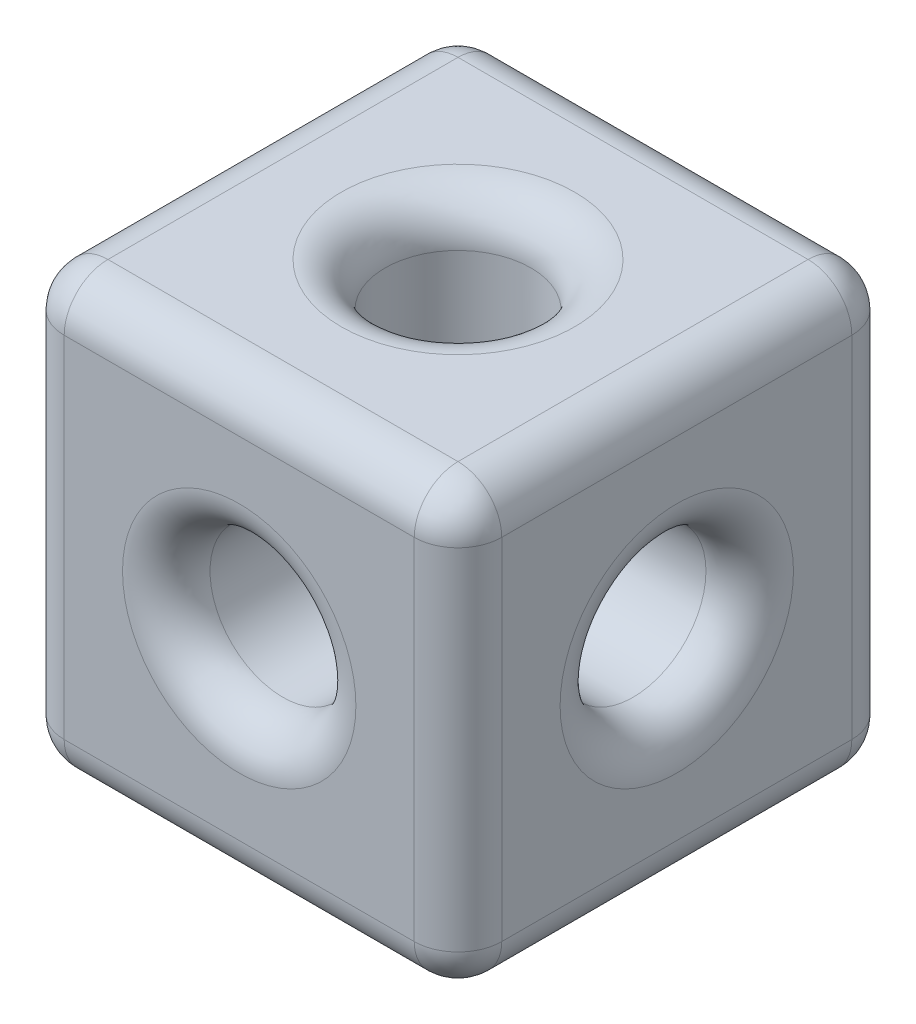
ISO-10303-21;
HEADER;
FILE_DESCRIPTION(('STEP AP214'),'2;1');
FILE_NAME('part.step','',(''),(''),'','','');
FILE_SCHEMA(('AUTOMOTIVE_DESIGN { 1 0 10303 214 1 1 1 1 }'));
ENDSEC;
DATA;
#1=APPLICATION_CONTEXT('core data for automotive mechanical design processes');
#2=APPLICATION_PROTOCOL_DEFINITION('international standard','automotive_design',2000,#1);
#3=PRODUCT_CONTEXT('',#1,'mechanical');
#4=PRODUCT('Part','Part','',(#3));
#5=PRODUCT_RELATED_PRODUCT_CATEGORY('part','',(#4));
#6=PRODUCT_DEFINITION_FORMATION('','',#4);
#7=PRODUCT_DEFINITION_CONTEXT('part definition',#1,'design');
#8=PRODUCT_DEFINITION('design','',#6,#7);
#9=PRODUCT_DEFINITION_SHAPE('','',#8);
#10=(LENGTH_UNIT() NAMED_UNIT(*) SI_UNIT(.MILLI.,.METRE.));
#11=(NAMED_UNIT(*) PLANE_ANGLE_UNIT() SI_UNIT($,.RADIAN.));
#12=(NAMED_UNIT(*) SI_UNIT($,.STERADIAN.) SOLID_ANGLE_UNIT());
#13=UNCERTAINTY_MEASURE_WITH_UNIT(LENGTH_MEASURE(1.E-05),#10,'distance_accuracy_value','');
#14=(GEOMETRIC_REPRESENTATION_CONTEXT(3) GLOBAL_UNCERTAINTY_ASSIGNED_CONTEXT((#13)) GLOBAL_UNIT_ASSIGNED_CONTEXT((#10,
#11,#12)) REPRESENTATION_CONTEXT('',''));
#15=CARTESIAN_POINT('',(0.,0.,0.));
#16=DIRECTION('',(0.,0.,1.));
#17=DIRECTION('',(1.,0.,0.));
#18=AXIS2_PLACEMENT_3D('',#15,#16,#17);
#19=CARTESIAN_POINT('',(0.,0.,-3.));
#20=DIRECTION('',(0.,0.,1.));
#21=DIRECTION('',(1.,0.,0.));
#22=AXIS2_PLACEMENT_3D('',#19,#20,#21);
#23=CYLINDRICAL_SURFACE('',#22,1.);
#24=CARTESIAN_POINT('',(0.,0.,2.4));
#25=DIRECTION('',(0.,0.,1.));
#26=DIRECTION('',(1.,0.,0.));
#27=AXIS2_PLACEMENT_3D('',#24,#25,#26);
#28=CIRCLE('',#27,1.);
#29=CARTESIAN_POINT('',(1.,0.,2.4));
#30=VERTEX_POINT('',#29);
#31=EDGE_CURVE('E255',#30,#30,#28,.T.);
#32=ORIENTED_EDGE('',*,*,#31,.T.);
#33=EDGE_LOOP('',(#32));
#34=FACE_BOUND('',#33,.T.);
#35=CARTESIAN_POINT('',(0.,0.,0.));
#36=DIRECTION('',(-0.707106781186547,0.,0.707106781186547));
#37=DIRECTION('',(0.707106781186547,0.,0.707106781186547));
#38=AXIS2_PLACEMENT_3D('',#35,#36,#37);
#39=ELLIPSE('',#38,1.41421356237309,1.);
#40=CARTESIAN_POINT('',(0.707106781186547,0.707106781186547,0.707106781186547));
#41=VERTEX_POINT('',#40);
#42=CARTESIAN_POINT('',(0.707106781186547,-0.707106781186547,0.707106781186547));
#43=VERTEX_POINT('',#42);
#44=EDGE_CURVE('E170',#41,#43,#39,.F.);
#45=ORIENTED_EDGE('',*,*,#44,.T.);
#46=CARTESIAN_POINT('',(0.,0.,0.));
#47=DIRECTION('',(0.,0.707106781186547,0.707106781186547));
#48=DIRECTION('',(0.,-0.707106781186547,0.707106781186547));
#49=AXIS2_PLACEMENT_3D('',#46,#47,#48);
#50=ELLIPSE('',#49,1.41421356237309,1.);
#51=CARTESIAN_POINT('',(-0.707106781186547,-0.707106781186547,0.707106781186547));
#52=VERTEX_POINT('',#51);
#53=EDGE_CURVE('E154',#43,#52,#50,.F.);
#54=ORIENTED_EDGE('',*,*,#53,.T.);
#55=CARTESIAN_POINT('',(0.,0.,0.));
#56=DIRECTION('',(0.707106781186547,0.,0.707106781186547));
#57=DIRECTION('',(-0.707106781186547,0.,0.707106781186547));
#58=AXIS2_PLACEMENT_3D('',#55,#56,#57);
#59=ELLIPSE('',#58,1.41421356237309,1.);
#60=CARTESIAN_POINT('',(-0.707106781186547,0.707106781186547,0.707106781186547));
#61=VERTEX_POINT('',#60);
#62=EDGE_CURVE('E163',#52,#61,#59,.F.);
#63=ORIENTED_EDGE('',*,*,#62,.T.);
#64=CARTESIAN_POINT('',(0.,0.,0.));
#65=DIRECTION('',(0.,-0.707106781186547,0.707106781186547));
#66=DIRECTION('',(0.,0.707106781186547,0.707106781186547));
#67=AXIS2_PLACEMENT_3D('',#64,#65,#66);
#68=ELLIPSE('',#67,1.41421356237309,1.);
#69=EDGE_CURVE('E343',#61,#41,#68,.F.);
#70=ORIENTED_EDGE('',*,*,#69,.T.);
#71=EDGE_LOOP('',(#45,#54,#63,#70));
#72=FACE_BOUND('',#71,.T.);
#73=ADVANCED_FACE('F38',(#34,#72),#23,.F.);
#74=CARTESIAN_POINT('',(3.,-3.,3.));
#75=DIRECTION('',(1.,0.,0.));
#76=DIRECTION('',(0.,0.,-1.));
#77=AXIS2_PLACEMENT_3D('',#74,#75,#76);
#78=PLANE('',#77);
#79=CARTESIAN_POINT('',(3.,0.,0.));
#80=DIRECTION('',(1.,0.,0.));
#81=DIRECTION('',(0.,0.,-1.));
#82=AXIS2_PLACEMENT_3D('',#79,#80,#81);
#83=CIRCLE('',#82,1.6);
#84=CARTESIAN_POINT('',(3.,0.,-1.6));
#85=VERTEX_POINT('',#84);
#86=EDGE_CURVE('E207',#85,#85,#83,.F.);
#87=ORIENTED_EDGE('',*,*,#86,.T.);
#88=EDGE_LOOP('',(#87));
#89=FACE_BOUND('',#88,.T.);
#90=DIRECTION('',(0.,1.,0.));
#91=VECTOR('',#90,1.);
#92=CARTESIAN_POINT('',(3.,-3.,2.4));
#93=LINE('',#92,#91);
#94=CARTESIAN_POINT('',(3.,2.4,2.4));
#95=VERTEX_POINT('',#94);
#96=CARTESIAN_POINT('',(3.,-2.4,2.4));
#97=VERTEX_POINT('',#96);
#98=EDGE_CURVE('E200',#95,#97,#93,.F.);
#99=ORIENTED_EDGE('',*,*,#98,.T.);
#100=DIRECTION('',(0.,0.,-1.));
#101=VECTOR('',#100,1.);
#102=CARTESIAN_POINT('',(3.,-2.4,3.));
#103=LINE('',#102,#101);
#104=CARTESIAN_POINT('',(3.,-2.4,-2.4));
#105=VERTEX_POINT('',#104);
#106=EDGE_CURVE('E204',#97,#105,#103,.T.);
#107=ORIENTED_EDGE('',*,*,#106,.T.);
#108=DIRECTION('',(0.,1.,0.));
#109=VECTOR('',#108,1.);
#110=CARTESIAN_POINT('',(3.,-3.,-2.4));
#111=LINE('',#110,#109);
#112=CARTESIAN_POINT('',(3.,2.4,-2.4));
#113=VERTEX_POINT('',#112);
#114=EDGE_CURVE('E202',#105,#113,#111,.T.);
#115=ORIENTED_EDGE('',*,*,#114,.T.);
#116=DIRECTION('',(0.,0.,-1.));
#117=VECTOR('',#116,1.);
#118=CARTESIAN_POINT('',(3.,2.4,3.));
#119=LINE('',#118,#117);
#120=EDGE_CURVE('E198',#113,#95,#119,.F.);
#121=ORIENTED_EDGE('',*,*,#120,.T.);
#122=EDGE_LOOP('',(#99,#107,#115,#121));
#123=FACE_BOUND('',#122,.T.);
#124=ADVANCED_FACE('F366',(#89,#123),#78,.T.);
#125=CARTESIAN_POINT('',(-3.,-3.,3.));
#126=DIRECTION('',(0.,0.,1.));
#127=DIRECTION('',(1.,0.,0.));
#128=AXIS2_PLACEMENT_3D('',#125,#126,#127);
#129=PLANE('',#128);
#130=CARTESIAN_POINT('',(0.,0.,3.));
#131=DIRECTION('',(0.,0.,1.));
#132=DIRECTION('',(1.,0.,0.));
#133=AXIS2_PLACEMENT_3D('',#130,#131,#132);
#134=CIRCLE('',#133,1.6);
#135=CARTESIAN_POINT('',(1.6,0.,3.));
#136=VERTEX_POINT('',#135);
#137=EDGE_CURVE('E252',#136,#136,#134,.F.);
#138=ORIENTED_EDGE('',*,*,#137,.T.);
#139=EDGE_LOOP('',(#138));
#140=FACE_BOUND('',#139,.T.);
#141=DIRECTION('',(0.,1.,0.));
#142=VECTOR('',#141,1.);
#143=CARTESIAN_POINT('',(-2.4,-3.,3.));
#144=LINE('',#143,#142);
#145=CARTESIAN_POINT('',(-2.4,2.4,3.));
#146=VERTEX_POINT('',#145);
#147=CARTESIAN_POINT('',(-2.4,-2.4,3.));
#148=VERTEX_POINT('',#147);
#149=EDGE_CURVE('E247',#146,#148,#144,.F.);
#150=ORIENTED_EDGE('',*,*,#149,.T.);
#151=DIRECTION('',(1.,0.,0.));
#152=VECTOR('',#151,1.);
#153=CARTESIAN_POINT('',(-3.,-2.4,3.));
#154=LINE('',#153,#152);
#155=CARTESIAN_POINT('',(2.4,-2.4,3.));
#156=VERTEX_POINT('',#155);
#157=EDGE_CURVE('E249',#148,#156,#154,.T.);
#158=ORIENTED_EDGE('',*,*,#157,.T.);
#159=DIRECTION('',(0.,1.,0.));
#160=VECTOR('',#159,1.);
#161=CARTESIAN_POINT('',(2.4,-3.,3.));
#162=LINE('',#161,#160);
#163=CARTESIAN_POINT('',(2.4,2.4,3.));
#164=VERTEX_POINT('',#163);
#165=EDGE_CURVE('E245',#156,#164,#162,.T.);
#166=ORIENTED_EDGE('',*,*,#165,.T.);
#167=DIRECTION('',(1.,0.,0.));
#168=VECTOR('',#167,1.);
#169=CARTESIAN_POINT('',(-3.,2.4,3.));
#170=LINE('',#169,#168);
#171=EDGE_CURVE('E243',#164,#146,#170,.F.);
#172=ORIENTED_EDGE('',*,*,#171,.T.);
#173=EDGE_LOOP('',(#150,#158,#166,#172));
#174=FACE_BOUND('',#173,.T.);
#175=ADVANCED_FACE('F371',(#140,#174),#129,.T.);
#176=CARTESIAN_POINT('',(-3.,-3.,3.));
#177=DIRECTION('',(-1.,0.,0.));
#178=DIRECTION('',(0.,0.,1.));
#179=AXIS2_PLACEMENT_3D('',#176,#177,#178);
#180=PLANE('',#179);
#181=CARTESIAN_POINT('',(-3.,0.,0.));
#182=DIRECTION('',(-1.,0.,0.));
#183=DIRECTION('',(0.,0.,1.));
#184=AXIS2_PLACEMENT_3D('',#181,#182,#183);
#185=CIRCLE('',#184,1.6);
#186=CARTESIAN_POINT('',(-3.,0.,1.6));
#187=VERTEX_POINT('',#186);
#188=EDGE_CURVE('E237',#187,#187,#185,.F.);
#189=ORIENTED_EDGE('',*,*,#188,.T.);
#190=EDGE_LOOP('',(#189));
#191=FACE_BOUND('',#190,.T.);
#192=DIRECTION('',(0.,1.,0.));
#193=VECTOR('',#192,1.);
#194=CARTESIAN_POINT('',(-3.,-3.,-2.4));
#195=LINE('',#194,#193);
#196=CARTESIAN_POINT('',(-3.,2.4,-2.4));
#197=VERTEX_POINT('',#196);
#198=CARTESIAN_POINT('',(-3.,-2.4,-2.4));
#199=VERTEX_POINT('',#198);
#200=EDGE_CURVE('E232',#197,#199,#195,.F.);
#201=ORIENTED_EDGE('',*,*,#200,.T.);
#202=DIRECTION('',(0.,0.,1.));
#203=VECTOR('',#202,1.);
#204=CARTESIAN_POINT('',(-3.,-2.4,3.));
#205=LINE('',#204,#203);
#206=CARTESIAN_POINT('',(-3.,-2.4,2.4));
#207=VERTEX_POINT('',#206);
#208=EDGE_CURVE('E234',#199,#207,#205,.T.);
#209=ORIENTED_EDGE('',*,*,#208,.T.);
#210=DIRECTION('',(0.,1.,0.));
#211=VECTOR('',#210,1.);
#212=CARTESIAN_POINT('',(-3.,-3.,2.4));
#213=LINE('',#212,#211);
#214=CARTESIAN_POINT('',(-3.,2.4,2.4));
#215=VERTEX_POINT('',#214);
#216=EDGE_CURVE('E230',#207,#215,#213,.T.);
#217=ORIENTED_EDGE('',*,*,#216,.T.);
#218=DIRECTION('',(0.,0.,1.));
#219=VECTOR('',#218,1.);
#220=CARTESIAN_POINT('',(-3.,2.4,-3.));
#221=LINE('',#220,#219);
#222=EDGE_CURVE('E228',#215,#197,#221,.F.);
#223=ORIENTED_EDGE('',*,*,#222,.T.);
#224=EDGE_LOOP('',(#201,#209,#217,#223));
#225=FACE_BOUND('',#224,.T.);
#226=ADVANCED_FACE('F384',(#191,#225),#180,.T.);
#227=CARTESIAN_POINT('',(-3.,-3.,-3.));
#228=DIRECTION('',(0.,0.,-1.));
#229=DIRECTION('',(-1.,0.,0.));
#230=AXIS2_PLACEMENT_3D('',#227,#228,#229);
#231=PLANE('',#230);
#232=CARTESIAN_POINT('',(0.,0.,-3.));
#233=DIRECTION('',(0.,0.,-1.));
#234=DIRECTION('',(-1.,0.,0.));
#235=AXIS2_PLACEMENT_3D('',#232,#233,#234);
#236=CIRCLE('',#235,1.6);
#237=CARTESIAN_POINT('',(-1.6,0.,-3.));
#238=VERTEX_POINT('',#237);
#239=EDGE_CURVE('E222',#238,#238,#236,.F.);
#240=ORIENTED_EDGE('',*,*,#239,.T.);
#241=EDGE_LOOP('',(#240));
#242=FACE_BOUND('',#241,.T.);
#243=DIRECTION('',(0.,1.,0.));
#244=VECTOR('',#243,1.);
#245=CARTESIAN_POINT('',(2.4,-3.,-3.));
#246=LINE('',#245,#244);
#247=CARTESIAN_POINT('',(2.4,2.4,-3.));
#248=VERTEX_POINT('',#247);
#249=CARTESIAN_POINT('',(2.4,-2.4,-3.));
#250=VERTEX_POINT('',#249);
#251=EDGE_CURVE('E217',#248,#250,#246,.F.);
#252=ORIENTED_EDGE('',*,*,#251,.T.);
#253=DIRECTION('',(-1.,0.,0.));
#254=VECTOR('',#253,1.);
#255=CARTESIAN_POINT('',(-3.,-2.4,-3.));
#256=LINE('',#255,#254);
#257=CARTESIAN_POINT('',(-2.4,-2.4,-3.));
#258=VERTEX_POINT('',#257);
#259=EDGE_CURVE('E219',#250,#258,#256,.T.);
#260=ORIENTED_EDGE('',*,*,#259,.T.);
#261=DIRECTION('',(0.,1.,0.));
#262=VECTOR('',#261,1.);
#263=CARTESIAN_POINT('',(-2.4,-3.,-3.));
#264=LINE('',#263,#262);
#265=CARTESIAN_POINT('',(-2.4,2.4,-3.));
#266=VERTEX_POINT('',#265);
#267=EDGE_CURVE('E215',#258,#266,#264,.T.);
#268=ORIENTED_EDGE('',*,*,#267,.T.);
#269=DIRECTION('',(-1.,0.,0.));
#270=VECTOR('',#269,1.);
#271=CARTESIAN_POINT('',(3.,2.4,-3.));
#272=LINE('',#271,#270);
#273=EDGE_CURVE('E213',#266,#248,#272,.F.);
#274=ORIENTED_EDGE('',*,*,#273,.T.);
#275=EDGE_LOOP('',(#252,#260,#268,#274));
#276=FACE_BOUND('',#275,.T.);
#277=ADVANCED_FACE('F380',(#242,#276),#231,.T.);
#278=CARTESIAN_POINT('',(0.,-3.,0.));
#279=DIRECTION('',(0.,-1.,0.));
#280=DIRECTION('',(0.,0.,-1.));
#281=AXIS2_PLACEMENT_3D('',#278,#279,#280);
#282=PLANE('',#281);
#283=CARTESIAN_POINT('',(0.,-3.,0.));
#284=DIRECTION('',(0.,-1.,0.));
#285=DIRECTION('',(0.,0.,-1.));
#286=AXIS2_PLACEMENT_3D('',#283,#284,#285);
#287=CIRCLE('',#286,1.6);
#288=CARTESIAN_POINT('',(0.,-3.,-1.6));
#289=VERTEX_POINT('',#288);
#290=EDGE_CURVE('E192',#289,#289,#287,.F.);
#291=ORIENTED_EDGE('',*,*,#290,.T.);
#292=EDGE_LOOP('',(#291));
#293=FACE_BOUND('',#292,.T.);
#294=DIRECTION('',(-1.,0.,0.));
#295=VECTOR('',#294,1.);
#296=CARTESIAN_POINT('',(0.,-3.,-2.4));
#297=LINE('',#296,#295);
#298=CARTESIAN_POINT('',(-2.4,-3.,-2.4));
#299=VERTEX_POINT('',#298);
#300=CARTESIAN_POINT('',(2.4,-3.,-2.4));
#301=VERTEX_POINT('',#300);
#302=EDGE_CURVE('E187',#299,#301,#297,.F.);
#303=ORIENTED_EDGE('',*,*,#302,.T.);
#304=DIRECTION('',(0.,0.,-1.));
#305=VECTOR('',#304,1.);
#306=CARTESIAN_POINT('',(2.4,-3.,0.));
#307=LINE('',#306,#305);
#308=CARTESIAN_POINT('',(2.4,-3.,2.4));
#309=VERTEX_POINT('',#308);
#310=EDGE_CURVE('E189',#301,#309,#307,.F.);
#311=ORIENTED_EDGE('',*,*,#310,.T.);
#312=DIRECTION('',(1.,0.,0.));
#313=VECTOR('',#312,1.);
#314=CARTESIAN_POINT('',(0.,-3.,2.4));
#315=LINE('',#314,#313);
#316=CARTESIAN_POINT('',(-2.4,-3.,2.4));
#317=VERTEX_POINT('',#316);
#318=EDGE_CURVE('E183',#309,#317,#315,.F.);
#319=ORIENTED_EDGE('',*,*,#318,.T.);
#320=DIRECTION('',(0.,0.,1.));
#321=VECTOR('',#320,1.);
#322=CARTESIAN_POINT('',(-2.4,-3.,0.));
#323=LINE('',#322,#321);
#324=EDGE_CURVE('E185',#317,#299,#323,.F.);
#325=ORIENTED_EDGE('',*,*,#324,.T.);
#326=EDGE_LOOP('',(#303,#311,#319,#325));
#327=FACE_BOUND('',#326,.T.);
#328=ADVANCED_FACE('F377',(#293,#327),#282,.T.);
#329=CARTESIAN_POINT('',(0.,3.,0.));
#330=DIRECTION('',(0.,-1.,0.));
#331=DIRECTION('',(0.,0.,-1.));
#332=AXIS2_PLACEMENT_3D('',#329,#330,#331);
#333=PLANE('',#332);
#334=DIRECTION('',(0.,0.,1.));
#335=VECTOR('',#334,1.);
#336=CARTESIAN_POINT('',(-2.4,3.,3.));
#337=LINE('',#336,#335);
#338=CARTESIAN_POINT('',(-2.4,3.,-2.4));
#339=VERTEX_POINT('',#338);
#340=CARTESIAN_POINT('',(-2.4,3.,2.4));
#341=VERTEX_POINT('',#340);
#342=EDGE_CURVE('E55',#339,#341,#337,.T.);
#343=ORIENTED_EDGE('',*,*,#342,.T.);
#344=DIRECTION('',(1.,0.,0.));
#345=VECTOR('',#344,1.);
#346=CARTESIAN_POINT('',(3.,3.,2.4));
#347=LINE('',#346,#345);
#348=CARTESIAN_POINT('',(2.4,3.,2.4));
#349=VERTEX_POINT('',#348);
#350=EDGE_CURVE('E47',#341,#349,#347,.T.);
#351=ORIENTED_EDGE('',*,*,#350,.T.);
#352=DIRECTION('',(0.,0.,-1.));
#353=VECTOR('',#352,1.);
#354=CARTESIAN_POINT('',(2.4,3.,-3.));
#355=LINE('',#354,#353);
#356=CARTESIAN_POINT('',(2.4,3.,-2.4));
#357=VERTEX_POINT('',#356);
#358=EDGE_CURVE('E261',#349,#357,#355,.T.);
#359=ORIENTED_EDGE('',*,*,#358,.T.);
#360=DIRECTION('',(-1.,0.,0.));
#361=VECTOR('',#360,1.);
#362=CARTESIAN_POINT('',(-3.,3.,-2.4));
#363=LINE('',#362,#361);
#364=EDGE_CURVE('E60',#357,#339,#363,.T.);
#365=ORIENTED_EDGE('',*,*,#364,.T.);
#366=EDGE_LOOP('',(#343,#351,#359,#365));
#367=FACE_BOUND('',#366,.T.);
#368=CARTESIAN_POINT('',(0.,3.,0.));
#369=DIRECTION('',(0.,-1.,0.));
#370=DIRECTION('',(0.,0.,-1.));
#371=AXIS2_PLACEMENT_3D('',#368,#369,#370);
#372=CIRCLE('',#371,1.6);
#373=CARTESIAN_POINT('',(0.,3.,-1.6));
#374=VERTEX_POINT('',#373);
#375=EDGE_CURVE('E258',#374,#374,#372,.T.);
#376=ORIENTED_EDGE('',*,*,#375,.T.);
#377=EDGE_LOOP('',(#376));
#378=FACE_BOUND('',#377,.T.);
#379=ADVANCED_FACE('F361',(#367,#378),#333,.F.);
#380=CARTESIAN_POINT('',(0.,0.,-2.4));
#381=DIRECTION('',(0.,0.,-1.));
#382=DIRECTION('',(-1.,0.,0.));
#383=AXIS2_PLACEMENT_3D('',#380,#381,#382);
#384=CIRCLE('',#383,1.);
#385=CARTESIAN_POINT('',(-1.,0.,-2.4));
#386=VERTEX_POINT('',#385);
#387=EDGE_CURVE('E225',#386,#386,#384,.T.);
#388=ORIENTED_EDGE('',*,*,#387,.T.);
#389=EDGE_LOOP('',(#388));
#390=FACE_BOUND('',#389,.T.);
#391=CARTESIAN_POINT('',(0.,0.,0.));
#392=DIRECTION('',(0.707106781186547,0.,0.707106781186547));
#393=DIRECTION('',(-0.707106781186547,0.,0.707106781186547));
#394=AXIS2_PLACEMENT_3D('',#391,#392,#393);
#395=ELLIPSE('',#394,1.41421356237309,1.);
#396=CARTESIAN_POINT('',(0.707106781186547,-0.707106781186547,-0.707106781186547));
#397=VERTEX_POINT('',#396);
#398=CARTESIAN_POINT('',(0.707106781186547,0.707106781186547,-0.707106781186547));
#399=VERTEX_POINT('',#398);
#400=EDGE_CURVE('E175',#397,#399,#395,.T.);
#401=ORIENTED_EDGE('',*,*,#400,.T.);
#402=CARTESIAN_POINT('',(0.,0.,0.));
#403=DIRECTION('',(0.,0.707106781186547,0.707106781186547));
#404=DIRECTION('',(0.,-0.707106781186547,0.707106781186547));
#405=AXIS2_PLACEMENT_3D('',#402,#403,#404);
#406=ELLIPSE('',#405,1.41421356237309,1.);
#407=CARTESIAN_POINT('',(-0.707106781186547,0.707106781186547,-0.707106781186547));
#408=VERTEX_POINT('',#407);
#409=EDGE_CURVE('E340',#399,#408,#406,.T.);
#410=ORIENTED_EDGE('',*,*,#409,.T.);
#411=CARTESIAN_POINT('',(0.,0.,0.));
#412=DIRECTION('',(-0.707106781186547,0.,0.707106781186547));
#413=DIRECTION('',(0.707106781186547,0.,0.707106781186547));
#414=AXIS2_PLACEMENT_3D('',#411,#412,#413);
#415=ELLIPSE('',#414,1.41421356237309,1.);
#416=CARTESIAN_POINT('',(-0.707106781186547,-0.707106781186547,-0.707106781186547));
#417=VERTEX_POINT('',#416);
#418=EDGE_CURVE('E178',#408,#417,#415,.T.);
#419=ORIENTED_EDGE('',*,*,#418,.T.);
#420=CARTESIAN_POINT('',(0.,0.,0.));
#421=DIRECTION('',(0.,-0.707106781186547,0.707106781186547));
#422=DIRECTION('',(0.,0.707106781186547,0.707106781186547));
#423=AXIS2_PLACEMENT_3D('',#420,#421,#422);
#424=ELLIPSE('',#423,1.41421356237309,1.);
#425=EDGE_CURVE('E157',#417,#397,#424,.T.);
#426=ORIENTED_EDGE('',*,*,#425,.T.);
#427=EDGE_LOOP('',(#401,#410,#419,#426));
#428=FACE_BOUND('',#427,.T.);
#429=ADVANCED_FACE('F348',(#390,#428),#23,.F.);
#430=CARTESIAN_POINT('',(-3.,0.,0.));
#431=DIRECTION('',(1.,0.,0.));
#432=DIRECTION('',(0.,0.,-1.));
#433=AXIS2_PLACEMENT_3D('',#430,#431,#432);
#434=CYLINDRICAL_SURFACE('',#433,1.);
#435=CARTESIAN_POINT('',(2.4,0.,0.));
#436=DIRECTION('',(1.,0.,0.));
#437=DIRECTION('',(0.,0.,-1.));
#438=AXIS2_PLACEMENT_3D('',#435,#436,#437);
#439=CIRCLE('',#438,1.);
#440=CARTESIAN_POINT('',(2.4,0.,-1.));
#441=VERTEX_POINT('',#440);
#442=EDGE_CURVE('E210',#441,#441,#439,.T.);
#443=ORIENTED_EDGE('',*,*,#442,.T.);
#444=EDGE_LOOP('',(#443));
#445=FACE_BOUND('',#444,.T.);
#446=ORIENTED_EDGE('',*,*,#400,.F.);
#447=CARTESIAN_POINT('',(0.,0.,0.));
#448=DIRECTION('',(0.707106781186547,0.707106781186547,0.));
#449=DIRECTION('',(0.707106781186547,-0.707106781186547,0.));
#450=AXIS2_PLACEMENT_3D('',#447,#448,#449);
#451=ELLIPSE('',#450,1.41421356237309,1.);
#452=EDGE_CURVE('E171',#397,#43,#451,.F.);
#453=ORIENTED_EDGE('',*,*,#452,.T.);
#454=ORIENTED_EDGE('',*,*,#44,.F.);
#455=CARTESIAN_POINT('',(0.,0.,0.));
#456=DIRECTION('',(0.707106781186547,-0.707106781186547,0.));
#457=DIRECTION('',(0.707106781186547,0.707106781186547,0.));
#458=AXIS2_PLACEMENT_3D('',#455,#456,#457);
#459=ELLIPSE('',#458,1.41421356237309,1.);
#460=EDGE_CURVE('E345',#41,#399,#459,.F.);
#461=ORIENTED_EDGE('',*,*,#460,.T.);
#462=EDGE_LOOP('',(#446,#453,#454,#461));
#463=FACE_BOUND('',#462,.T.);
#464=ADVANCED_FACE('F352',(#445,#463),#434,.F.);
#465=CARTESIAN_POINT('',(-2.4,0.,0.));
#466=DIRECTION('',(-1.,0.,0.));
#467=DIRECTION('',(0.,0.,1.));
#468=AXIS2_PLACEMENT_3D('',#465,#466,#467);
#469=CIRCLE('',#468,1.);
#470=CARTESIAN_POINT('',(-2.4,0.,1.));
#471=VERTEX_POINT('',#470);
#472=EDGE_CURVE('E240',#471,#471,#469,.T.);
#473=ORIENTED_EDGE('',*,*,#472,.T.);
#474=EDGE_LOOP('',(#473));
#475=FACE_BOUND('',#474,.T.);
#476=ORIENTED_EDGE('',*,*,#418,.F.);
#477=CARTESIAN_POINT('',(0.,0.,0.));
#478=DIRECTION('',(0.707106781186547,0.707106781186547,0.));
#479=DIRECTION('',(0.707106781186547,-0.707106781186547,0.));
#480=AXIS2_PLACEMENT_3D('',#477,#478,#479);
#481=ELLIPSE('',#480,1.41421356237309,1.);
#482=EDGE_CURVE('E162',#408,#61,#481,.T.);
#483=ORIENTED_EDGE('',*,*,#482,.T.);
#484=ORIENTED_EDGE('',*,*,#62,.F.);
#485=CARTESIAN_POINT('',(0.,0.,0.));
#486=DIRECTION('',(0.707106781186547,-0.707106781186547,0.));
#487=DIRECTION('',(0.707106781186547,0.707106781186547,0.));
#488=AXIS2_PLACEMENT_3D('',#485,#486,#487);
#489=ELLIPSE('',#488,1.41421356237309,1.);
#490=EDGE_CURVE('E151',#52,#417,#489,.T.);
#491=ORIENTED_EDGE('',*,*,#490,.T.);
#492=EDGE_LOOP('',(#476,#483,#484,#491));
#493=FACE_BOUND('',#492,.T.);
#494=ADVANCED_FACE('F174',(#475,#493),#434,.F.);
#495=CARTESIAN_POINT('',(0.,-3.,0.));
#496=DIRECTION('',(0.,1.,0.));
#497=DIRECTION('',(0.,0.,1.));
#498=AXIS2_PLACEMENT_3D('',#495,#496,#497);
#499=CYLINDRICAL_SURFACE('',#498,1.);
#500=CARTESIAN_POINT('',(0.,-2.4,0.));
#501=DIRECTION('',(0.,-1.,0.));
#502=DIRECTION('',(0.,0.,-1.));
#503=AXIS2_PLACEMENT_3D('',#500,#501,#502);
#504=CIRCLE('',#503,1.);
#505=CARTESIAN_POINT('',(0.,-2.4,-1.));
#506=VERTEX_POINT('',#505);
#507=EDGE_CURVE('E195',#506,#506,#504,.T.);
#508=ORIENTED_EDGE('',*,*,#507,.T.);
#509=EDGE_LOOP('',(#508));
#510=FACE_BOUND('',#509,.T.);
#511=ORIENTED_EDGE('',*,*,#425,.F.);
#512=ORIENTED_EDGE('',*,*,#490,.F.);
#513=ORIENTED_EDGE('',*,*,#53,.F.);
#514=ORIENTED_EDGE('',*,*,#452,.F.);
#515=EDGE_LOOP('',(#511,#512,#513,#514));
#516=FACE_BOUND('',#515,.T.);
#517=ADVANCED_FACE('F153',(#510,#516),#499,.F.);
#518=CARTESIAN_POINT('',(0.,2.4,0.));
#519=DIRECTION('',(0.,-1.,0.));
#520=DIRECTION('',(0.,0.,-1.));
#521=AXIS2_PLACEMENT_3D('',#518,#519,#520);
#522=CIRCLE('',#521,1.);
#523=CARTESIAN_POINT('',(0.,2.4,-1.));
#524=VERTEX_POINT('',#523);
#525=EDGE_CURVE('E11',#524,#524,#522,.F.);
#526=ORIENTED_EDGE('',*,*,#525,.T.);
#527=EDGE_LOOP('',(#526));
#528=FACE_BOUND('',#527,.T.);
#529=ORIENTED_EDGE('',*,*,#69,.F.);
#530=ORIENTED_EDGE('',*,*,#482,.F.);
#531=ORIENTED_EDGE('',*,*,#409,.F.);
#532=ORIENTED_EDGE('',*,*,#460,.F.);
#533=EDGE_LOOP('',(#529,#530,#531,#532));
#534=FACE_BOUND('',#533,.T.);
#535=ADVANCED_FACE('F350',(#528,#534),#499,.F.);
#536=CARTESIAN_POINT('',(0.,-2.4,0.));
#537=DIRECTION('',(0.,-1.,0.));
#538=DIRECTION('',(0.,0.,-1.));
#539=AXIS2_PLACEMENT_3D('',#536,#537,#538);
#540=TOROIDAL_SURFACE('',#539,1.6,0.6);
#541=ORIENTED_EDGE('',*,*,#507,.F.);
#542=EDGE_LOOP('',(#541));
#543=FACE_BOUND('',#542,.T.);
#544=ORIENTED_EDGE('',*,*,#290,.F.);
#545=EDGE_LOOP('',(#544));
#546=FACE_BOUND('',#545,.T.);
#547=ADVANCED_FACE('F392',(#543,#546),#540,.T.);
#548=CARTESIAN_POINT('',(-2.4,2.4,0.));
#549=DIRECTION('',(0.,0.,-1.));
#550=DIRECTION('',(-1.,0.,0.));
#551=AXIS2_PLACEMENT_3D('',#548,#549,#550);
#552=CYLINDRICAL_SURFACE('',#551,0.6);
#553=CARTESIAN_POINT('',(-2.4,2.4,2.4));
#554=DIRECTION('',(0.,0.,1.));
#555=DIRECTION('',(1.,0.,0.));
#556=AXIS2_PLACEMENT_3D('',#553,#554,#555);
#557=CIRCLE('',#556,0.6);
#558=EDGE_CURVE('E42',#341,#215,#557,.T.);
#559=ORIENTED_EDGE('',*,*,#558,.F.);
#560=ORIENTED_EDGE('',*,*,#342,.F.);
#561=CARTESIAN_POINT('',(-2.4,2.4,-2.4));
#562=DIRECTION('',(0.,0.,-1.));
#563=DIRECTION('',(-1.,0.,0.));
#564=AXIS2_PLACEMENT_3D('',#561,#562,#563);
#565=CIRCLE('',#564,0.6);
#566=EDGE_CURVE('E325',#197,#339,#565,.T.);
#567=ORIENTED_EDGE('',*,*,#566,.F.);
#568=ORIENTED_EDGE('',*,*,#222,.F.);
#569=EDGE_LOOP('',(#559,#560,#567,#568));
#570=FACE_BOUND('',#569,.T.);
#571=ADVANCED_FACE('F395',(#570),#552,.T.);
#572=CARTESIAN_POINT('',(-2.4,2.4,2.4));
#573=DIRECTION('',(-1.,0.,0.));
#574=DIRECTION('',(0.,0.,1.));
#575=AXIS2_PLACEMENT_3D('',#572,#573,#574);
#576=SPHERICAL_SURFACE('',#575,0.6);
#577=CARTESIAN_POINT('',(-2.4,2.4,2.4));
#578=DIRECTION('',(-1.,0.,0.));
#579=DIRECTION('',(0.,0.,1.));
#580=AXIS2_PLACEMENT_3D('',#577,#578,#579);
#581=CIRCLE('',#580,0.6);
#582=EDGE_CURVE('E320',#341,#146,#581,.F.);
#583=ORIENTED_EDGE('',*,*,#582,.F.);
#584=ORIENTED_EDGE('',*,*,#558,.T.);
#585=CARTESIAN_POINT('',(-2.4,2.4,2.4));
#586=DIRECTION('',(0.,1.,0.));
#587=DIRECTION('',(0.,0.,1.));
#588=AXIS2_PLACEMENT_3D('',#585,#586,#587);
#589=CIRCLE('',#588,0.6);
#590=EDGE_CURVE('E323',#146,#215,#589,.F.);
#591=ORIENTED_EDGE('',*,*,#590,.F.);
#592=EDGE_LOOP('',(#583,#584,#591));
#593=FACE_BOUND('',#592,.T.);
#594=ADVANCED_FACE('F469',(#593),#576,.T.);
#595=CARTESIAN_POINT('',(-2.4,2.4,-2.4));
#596=DIRECTION('',(0.,1.,0.));
#597=DIRECTION('',(0.,0.,1.));
#598=AXIS2_PLACEMENT_3D('',#595,#596,#597);
#599=SPHERICAL_SURFACE('',#598,0.6);
#600=CARTESIAN_POINT('',(-2.4,2.4,-2.4));
#601=DIRECTION('',(0.,1.,0.));
#602=DIRECTION('',(0.,0.,1.));
#603=AXIS2_PLACEMENT_3D('',#600,#601,#602);
#604=CIRCLE('',#603,0.6);
#605=EDGE_CURVE('E314',#197,#266,#604,.F.);
#606=ORIENTED_EDGE('',*,*,#605,.F.);
#607=ORIENTED_EDGE('',*,*,#566,.T.);
#608=CARTESIAN_POINT('',(-2.4,2.4,-2.4));
#609=DIRECTION('',(-1.,0.,0.));
#610=DIRECTION('',(0.,0.,1.));
#611=AXIS2_PLACEMENT_3D('',#608,#609,#610);
#612=CIRCLE('',#611,0.6);
#613=EDGE_CURVE('E317',#266,#339,#612,.F.);
#614=ORIENTED_EDGE('',*,*,#613,.F.);
#615=EDGE_LOOP('',(#606,#607,#614));
#616=FACE_BOUND('',#615,.T.);
#617=ADVANCED_FACE('F465',(#616),#599,.T.);
#618=CARTESIAN_POINT('',(-2.4,-3.,2.4));
#619=DIRECTION('',(0.,1.,0.));
#620=DIRECTION('',(0.,0.,1.));
#621=AXIS2_PLACEMENT_3D('',#618,#619,#620);
#622=CYLINDRICAL_SURFACE('',#621,0.6);
#623=ORIENTED_EDGE('',*,*,#590,.T.);
#624=ORIENTED_EDGE('',*,*,#216,.F.);
#625=CARTESIAN_POINT('',(-2.4,-2.4,2.4));
#626=DIRECTION('',(0.,-1.,0.));
#627=DIRECTION('',(0.,0.,-1.));
#628=AXIS2_PLACEMENT_3D('',#625,#626,#627);
#629=CIRCLE('',#628,0.6);
#630=EDGE_CURVE('E309',#148,#207,#629,.T.);
#631=ORIENTED_EDGE('',*,*,#630,.F.);
#632=ORIENTED_EDGE('',*,*,#149,.F.);
#633=EDGE_LOOP('',(#623,#624,#631,#632));
#634=FACE_BOUND('',#633,.T.);
#635=ADVANCED_FACE('F461',(#634),#622,.T.);
#636=CARTESIAN_POINT('',(0.,2.4,2.4));
#637=DIRECTION('',(-1.,0.,0.));
#638=DIRECTION('',(0.,0.,1.));
#639=AXIS2_PLACEMENT_3D('',#636,#637,#638);
#640=CYLINDRICAL_SURFACE('',#639,0.6);
#641=ORIENTED_EDGE('',*,*,#582,.T.);
#642=ORIENTED_EDGE('',*,*,#171,.F.);
#643=CARTESIAN_POINT('',(2.4,2.4,2.4));
#644=DIRECTION('',(1.,0.,0.));
#645=DIRECTION('',(0.,0.,-1.));
#646=AXIS2_PLACEMENT_3D('',#643,#644,#645);
#647=CIRCLE('',#646,0.6);
#648=EDGE_CURVE('E306',#349,#164,#647,.T.);
#649=ORIENTED_EDGE('',*,*,#648,.F.);
#650=ORIENTED_EDGE('',*,*,#350,.F.);
#651=EDGE_LOOP('',(#641,#642,#649,#650));
#652=FACE_BOUND('',#651,.T.);
#653=ADVANCED_FACE('F457',(#652),#640,.T.);
#654=CARTESIAN_POINT('',(2.4,2.4,0.));
#655=DIRECTION('',(0.,0.,1.));
#656=DIRECTION('',(1.,0.,0.));
#657=AXIS2_PLACEMENT_3D('',#654,#655,#656);
#658=CYLINDRICAL_SURFACE('',#657,0.6);
#659=CARTESIAN_POINT('',(2.4,2.4,-2.4));
#660=DIRECTION('',(0.,0.,-1.));
#661=DIRECTION('',(-1.,0.,0.));
#662=AXIS2_PLACEMENT_3D('',#659,#660,#661);
#663=CIRCLE('',#662,0.6);
#664=EDGE_CURVE('E301',#357,#113,#663,.T.);
#665=ORIENTED_EDGE('',*,*,#664,.F.);
#666=ORIENTED_EDGE('',*,*,#358,.F.);
#667=CARTESIAN_POINT('',(2.4,2.4,2.4));
#668=DIRECTION('',(0.,0.,1.));
#669=DIRECTION('',(1.,0.,0.));
#670=AXIS2_PLACEMENT_3D('',#667,#668,#669);
#671=CIRCLE('',#670,0.6);
#672=EDGE_CURVE('E304',#95,#349,#671,.T.);
#673=ORIENTED_EDGE('',*,*,#672,.F.);
#674=ORIENTED_EDGE('',*,*,#120,.F.);
#675=EDGE_LOOP('',(#665,#666,#673,#674));
#676=FACE_BOUND('',#675,.T.);
#677=ADVANCED_FACE('F453',(#676),#658,.T.);
#678=CARTESIAN_POINT('',(0.,2.4,-2.4));
#679=DIRECTION('',(1.,0.,0.));
#680=DIRECTION('',(0.,0.,-1.));
#681=AXIS2_PLACEMENT_3D('',#678,#679,#680);
#682=CYLINDRICAL_SURFACE('',#681,0.6);
#683=ORIENTED_EDGE('',*,*,#613,.T.);
#684=ORIENTED_EDGE('',*,*,#364,.F.);
#685=CARTESIAN_POINT('',(2.4,2.4,-2.4));
#686=DIRECTION('',(1.,0.,0.));
#687=DIRECTION('',(0.,0.,-1.));
#688=AXIS2_PLACEMENT_3D('',#685,#686,#687);
#689=CIRCLE('',#688,0.6);
#690=EDGE_CURVE('E298',#248,#357,#689,.T.);
#691=ORIENTED_EDGE('',*,*,#690,.F.);
#692=ORIENTED_EDGE('',*,*,#273,.F.);
#693=EDGE_LOOP('',(#683,#684,#691,#692));
#694=FACE_BOUND('',#693,.T.);
#695=ADVANCED_FACE('F449',(#694),#682,.T.);
#696=CARTESIAN_POINT('',(-2.4,-3.,-2.4));
#697=DIRECTION('',(0.,1.,0.));
#698=DIRECTION('',(0.,0.,1.));
#699=AXIS2_PLACEMENT_3D('',#696,#697,#698);
#700=CYLINDRICAL_SURFACE('',#699,0.6);
#701=ORIENTED_EDGE('',*,*,#605,.T.);
#702=ORIENTED_EDGE('',*,*,#267,.F.);
#703=CARTESIAN_POINT('',(-2.4,-2.4,-2.4));
#704=DIRECTION('',(0.,-1.,0.));
#705=DIRECTION('',(0.,0.,-1.));
#706=AXIS2_PLACEMENT_3D('',#703,#704,#705);
#707=CIRCLE('',#706,0.6);
#708=EDGE_CURVE('E295',#199,#258,#707,.T.);
#709=ORIENTED_EDGE('',*,*,#708,.F.);
#710=ORIENTED_EDGE('',*,*,#200,.F.);
#711=EDGE_LOOP('',(#701,#702,#709,#710));
#712=FACE_BOUND('',#711,.T.);
#713=ADVANCED_FACE('F445',(#712),#700,.T.);
#714=CARTESIAN_POINT('',(-2.4,-2.4,3.));
#715=DIRECTION('',(0.,0.,1.));
#716=DIRECTION('',(1.,0.,0.));
#717=AXIS2_PLACEMENT_3D('',#714,#715,#716);
#718=CYLINDRICAL_SURFACE('',#717,0.6);
#719=CARTESIAN_POINT('',(-2.4,-2.4,2.4));
#720=DIRECTION('',(0.,0.,1.));
#721=DIRECTION('',(1.,0.,0.));
#722=AXIS2_PLACEMENT_3D('',#719,#720,#721);
#723=CIRCLE('',#722,0.6);
#724=EDGE_CURVE('E311',#207,#317,#723,.T.);
#725=ORIENTED_EDGE('',*,*,#724,.F.);
#726=ORIENTED_EDGE('',*,*,#208,.F.);
#727=CARTESIAN_POINT('',(-2.4,-2.4,-2.4));
#728=DIRECTION('',(0.,0.,-1.));
#729=DIRECTION('',(-1.,0.,0.));
#730=AXIS2_PLACEMENT_3D('',#727,#728,#729);
#731=CIRCLE('',#730,0.6);
#732=EDGE_CURVE('E292',#299,#199,#731,.T.);
#733=ORIENTED_EDGE('',*,*,#732,.F.);
#734=ORIENTED_EDGE('',*,*,#324,.F.);
#735=EDGE_LOOP('',(#725,#726,#733,#734));
#736=FACE_BOUND('',#735,.T.);
#737=ADVANCED_FACE('F441',(#736),#718,.T.);
#738=CARTESIAN_POINT('',(-2.4,-2.4,2.4));
#739=DIRECTION('',(-1.,0.,0.));
#740=DIRECTION('',(0.,0.,1.));
#741=AXIS2_PLACEMENT_3D('',#738,#739,#740);
#742=SPHERICAL_SURFACE('',#741,0.6);
#743=ORIENTED_EDGE('',*,*,#630,.T.);
#744=ORIENTED_EDGE('',*,*,#724,.T.);
#745=CARTESIAN_POINT('',(-2.4,-2.4,2.4));
#746=DIRECTION('',(-1.,0.,0.));
#747=DIRECTION('',(0.,0.,1.));
#748=AXIS2_PLACEMENT_3D('',#745,#746,#747);
#749=CIRCLE('',#748,0.6);
#750=EDGE_CURVE('E289',#148,#317,#749,.F.);
#751=ORIENTED_EDGE('',*,*,#750,.F.);
#752=EDGE_LOOP('',(#743,#744,#751));
#753=FACE_BOUND('',#752,.T.);
#754=ADVANCED_FACE('F437',(#753),#742,.T.);
#755=CARTESIAN_POINT('',(2.4,2.4,2.4));
#756=DIRECTION('',(0.,1.,0.));
#757=DIRECTION('',(0.,0.,1.));
#758=AXIS2_PLACEMENT_3D('',#755,#756,#757);
#759=SPHERICAL_SURFACE('',#758,0.6);
#760=ORIENTED_EDGE('',*,*,#672,.T.);
#761=ORIENTED_EDGE('',*,*,#648,.T.);
#762=CARTESIAN_POINT('',(2.4,2.4,2.4));
#763=DIRECTION('',(0.,1.,0.));
#764=DIRECTION('',(0.,0.,1.));
#765=AXIS2_PLACEMENT_3D('',#762,#763,#764);
#766=CIRCLE('',#765,0.6);
#767=EDGE_CURVE('E286',#95,#164,#766,.F.);
#768=ORIENTED_EDGE('',*,*,#767,.F.);
#769=EDGE_LOOP('',(#760,#761,#768));
#770=FACE_BOUND('',#769,.T.);
#771=ADVANCED_FACE('F433',(#770),#759,.T.);
#772=CARTESIAN_POINT('',(2.4,2.4,-2.4));
#773=DIRECTION('',(0.,1.,0.));
#774=DIRECTION('',(0.,0.,1.));
#775=AXIS2_PLACEMENT_3D('',#772,#773,#774);
#776=SPHERICAL_SURFACE('',#775,0.6);
#777=ORIENTED_EDGE('',*,*,#690,.T.);
#778=ORIENTED_EDGE('',*,*,#664,.T.);
#779=CARTESIAN_POINT('',(2.4,2.4,-2.4));
#780=DIRECTION('',(0.,1.,0.));
#781=DIRECTION('',(0.,0.,1.));
#782=AXIS2_PLACEMENT_3D('',#779,#780,#781);
#783=CIRCLE('',#782,0.6);
#784=EDGE_CURVE('E283',#248,#113,#783,.F.);
#785=ORIENTED_EDGE('',*,*,#784,.F.);
#786=EDGE_LOOP('',(#777,#778,#785));
#787=FACE_BOUND('',#786,.T.);
#788=ADVANCED_FACE('F429',(#787),#776,.T.);
#789=CARTESIAN_POINT('',(-2.4,-2.4,-2.4));
#790=DIRECTION('',(-1.,0.,0.));
#791=DIRECTION('',(0.,0.,1.));
#792=AXIS2_PLACEMENT_3D('',#789,#790,#791);
#793=SPHERICAL_SURFACE('',#792,0.6);
#794=ORIENTED_EDGE('',*,*,#732,.T.);
#795=ORIENTED_EDGE('',*,*,#708,.T.);
#796=CARTESIAN_POINT('',(-2.4,-2.4,-2.4));
#797=DIRECTION('',(-1.,0.,0.));
#798=DIRECTION('',(0.,-1.,0.));
#799=AXIS2_PLACEMENT_3D('',#796,#797,#798);
#800=CIRCLE('',#799,0.6);
#801=EDGE_CURVE('E281',#299,#258,#800,.F.);
#802=ORIENTED_EDGE('',*,*,#801,.F.);
#803=EDGE_LOOP('',(#794,#795,#802));
#804=FACE_BOUND('',#803,.T.);
#805=ADVANCED_FACE('F425',(#804),#793,.T.);
#806=CARTESIAN_POINT('',(-3.,-2.4,2.4));
#807=DIRECTION('',(1.,0.,0.));
#808=DIRECTION('',(0.,0.,-1.));
#809=AXIS2_PLACEMENT_3D('',#806,#807,#808);
#810=CYLINDRICAL_SURFACE('',#809,0.6);
#811=ORIENTED_EDGE('',*,*,#750,.T.);
#812=ORIENTED_EDGE('',*,*,#318,.F.);
#813=CARTESIAN_POINT('',(2.4,-2.4,2.4));
#814=DIRECTION('',(1.,0.,0.));
#815=DIRECTION('',(0.,0.,-1.));
#816=AXIS2_PLACEMENT_3D('',#813,#814,#815);
#817=CIRCLE('',#816,0.6);
#818=EDGE_CURVE('E278',#156,#309,#817,.T.);
#819=ORIENTED_EDGE('',*,*,#818,.F.);
#820=ORIENTED_EDGE('',*,*,#157,.F.);
#821=EDGE_LOOP('',(#811,#812,#819,#820));
#822=FACE_BOUND('',#821,.T.);
#823=ADVANCED_FACE('F421',(#822),#810,.T.);
#824=CARTESIAN_POINT('',(2.4,-3.,2.4));
#825=DIRECTION('',(0.,1.,0.));
#826=DIRECTION('',(0.,0.,1.));
#827=AXIS2_PLACEMENT_3D('',#824,#825,#826);
#828=CYLINDRICAL_SURFACE('',#827,0.6);
#829=ORIENTED_EDGE('',*,*,#767,.T.);
#830=ORIENTED_EDGE('',*,*,#165,.F.);
#831=CARTESIAN_POINT('',(2.4,-2.4,2.4));
#832=DIRECTION('',(0.,-1.,0.));
#833=DIRECTION('',(0.,0.,-1.));
#834=AXIS2_PLACEMENT_3D('',#831,#832,#833);
#835=CIRCLE('',#834,0.6);
#836=EDGE_CURVE('E276',#97,#156,#835,.T.);
#837=ORIENTED_EDGE('',*,*,#836,.F.);
#838=ORIENTED_EDGE('',*,*,#98,.F.);
#839=EDGE_LOOP('',(#829,#830,#837,#838));
#840=FACE_BOUND('',#839,.T.);
#841=ADVANCED_FACE('F417',(#840),#828,.T.);
#842=CARTESIAN_POINT('',(2.4,-3.,-2.4));
#843=DIRECTION('',(0.,1.,0.));
#844=DIRECTION('',(0.,0.,1.));
#845=AXIS2_PLACEMENT_3D('',#842,#843,#844);
#846=CYLINDRICAL_SURFACE('',#845,0.6);
#847=ORIENTED_EDGE('',*,*,#784,.T.);
#848=ORIENTED_EDGE('',*,*,#114,.F.);
#849=CARTESIAN_POINT('',(2.4,-2.4,-2.4));
#850=DIRECTION('',(0.,-1.,0.));
#851=DIRECTION('',(0.,0.,-1.));
#852=AXIS2_PLACEMENT_3D('',#849,#850,#851);
#853=CIRCLE('',#852,0.6);
#854=EDGE_CURVE('E273',#250,#105,#853,.T.);
#855=ORIENTED_EDGE('',*,*,#854,.F.);
#856=ORIENTED_EDGE('',*,*,#251,.F.);
#857=EDGE_LOOP('',(#847,#848,#855,#856));
#858=FACE_BOUND('',#857,.T.);
#859=ADVANCED_FACE('F413',(#858),#846,.T.);
#860=CARTESIAN_POINT('',(-3.,-2.4,-2.4));
#861=DIRECTION('',(-1.,0.,0.));
#862=DIRECTION('',(0.,0.,1.));
#863=AXIS2_PLACEMENT_3D('',#860,#861,#862);
#864=CYLINDRICAL_SURFACE('',#863,0.6);
#865=ORIENTED_EDGE('',*,*,#801,.T.);
#866=ORIENTED_EDGE('',*,*,#259,.F.);
#867=CARTESIAN_POINT('',(2.4,-2.4,-2.4));
#868=DIRECTION('',(1.,0.,0.));
#869=DIRECTION('',(0.,0.,-1.));
#870=AXIS2_PLACEMENT_3D('',#867,#868,#869);
#871=CIRCLE('',#870,0.6);
#872=EDGE_CURVE('E270',#301,#250,#871,.T.);
#873=ORIENTED_EDGE('',*,*,#872,.F.);
#874=ORIENTED_EDGE('',*,*,#302,.F.);
#875=EDGE_LOOP('',(#865,#866,#873,#874));
#876=FACE_BOUND('',#875,.T.);
#877=ADVANCED_FACE('F409',(#876),#864,.T.);
#878=CARTESIAN_POINT('',(2.4,-2.4,2.4));
#879=DIRECTION('',(0.,0.,1.));
#880=DIRECTION('',(1.,0.,0.));
#881=AXIS2_PLACEMENT_3D('',#878,#879,#880);
#882=SPHERICAL_SURFACE('',#881,0.6);
#883=ORIENTED_EDGE('',*,*,#836,.T.);
#884=ORIENTED_EDGE('',*,*,#818,.T.);
#885=CARTESIAN_POINT('',(2.4,-2.4,2.4));
#886=DIRECTION('',(0.,0.,1.));
#887=DIRECTION('',(1.,0.,0.));
#888=AXIS2_PLACEMENT_3D('',#885,#886,#887);
#889=CIRCLE('',#888,0.6);
#890=EDGE_CURVE('E268',#97,#309,#889,.F.);
#891=ORIENTED_EDGE('',*,*,#890,.F.);
#892=EDGE_LOOP('',(#883,#884,#891));
#893=FACE_BOUND('',#892,.T.);
#894=ADVANCED_FACE('F405',(#893),#882,.T.);
#895=CARTESIAN_POINT('',(2.4,-2.4,-2.4));
#896=DIRECTION('',(0.,0.,-1.));
#897=DIRECTION('',(-1.,0.,0.));
#898=AXIS2_PLACEMENT_3D('',#895,#896,#897);
#899=SPHERICAL_SURFACE('',#898,0.6);
#900=ORIENTED_EDGE('',*,*,#872,.T.);
#901=ORIENTED_EDGE('',*,*,#854,.T.);
#902=CARTESIAN_POINT('',(2.4,-2.4,-2.4));
#903=DIRECTION('',(0.,0.,-1.));
#904=DIRECTION('',(-1.,0.,0.));
#905=AXIS2_PLACEMENT_3D('',#902,#903,#904);
#906=CIRCLE('',#905,0.6);
#907=EDGE_CURVE('E266',#301,#105,#906,.F.);
#908=ORIENTED_EDGE('',*,*,#907,.F.);
#909=EDGE_LOOP('',(#900,#901,#908));
#910=FACE_BOUND('',#909,.T.);
#911=ADVANCED_FACE('F401',(#910),#899,.T.);
#912=CARTESIAN_POINT('',(2.4,-2.4,3.));
#913=DIRECTION('',(0.,0.,-1.));
#914=DIRECTION('',(-1.,0.,0.));
#915=AXIS2_PLACEMENT_3D('',#912,#913,#914);
#916=CYLINDRICAL_SURFACE('',#915,0.6);
#917=ORIENTED_EDGE('',*,*,#890,.T.);
#918=ORIENTED_EDGE('',*,*,#310,.F.);
#919=ORIENTED_EDGE('',*,*,#907,.T.);
#920=ORIENTED_EDGE('',*,*,#106,.F.);
#921=EDGE_LOOP('',(#917,#918,#919,#920));
#922=FACE_BOUND('',#921,.T.);
#923=ADVANCED_FACE('F397',(#922),#916,.T.);
#924=CARTESIAN_POINT('',(2.4,0.,0.));
#925=DIRECTION('',(1.,0.,0.));
#926=DIRECTION('',(0.,0.,-1.));
#927=AXIS2_PLACEMENT_3D('',#924,#925,#926);
#928=TOROIDAL_SURFACE('',#927,1.6,0.6);
#929=ORIENTED_EDGE('',*,*,#86,.F.);
#930=EDGE_LOOP('',(#929));
#931=FACE_BOUND('',#930,.T.);
#932=ORIENTED_EDGE('',*,*,#442,.F.);
#933=EDGE_LOOP('',(#932));
#934=FACE_BOUND('',#933,.T.);
#935=ADVANCED_FACE('F400',(#931,#934),#928,.T.);
#936=CARTESIAN_POINT('',(0.,0.,-2.4));
#937=DIRECTION('',(0.,0.,-1.));
#938=DIRECTION('',(-1.,0.,0.));
#939=AXIS2_PLACEMENT_3D('',#936,#937,#938);
#940=TOROIDAL_SURFACE('',#939,1.6,0.6);
#941=ORIENTED_EDGE('',*,*,#387,.F.);
#942=EDGE_LOOP('',(#941));
#943=FACE_BOUND('',#942,.T.);
#944=ORIENTED_EDGE('',*,*,#239,.F.);
#945=EDGE_LOOP('',(#944));
#946=FACE_BOUND('',#945,.T.);
#947=ADVANCED_FACE('F477',(#943,#946),#940,.T.);
#948=CARTESIAN_POINT('',(-2.4,0.,0.));
#949=DIRECTION('',(-1.,0.,0.));
#950=DIRECTION('',(0.,0.,1.));
#951=AXIS2_PLACEMENT_3D('',#948,#949,#950);
#952=TOROIDAL_SURFACE('',#951,1.6,0.6);
#953=ORIENTED_EDGE('',*,*,#472,.F.);
#954=EDGE_LOOP('',(#953));
#955=FACE_BOUND('',#954,.T.);
#956=ORIENTED_EDGE('',*,*,#188,.F.);
#957=EDGE_LOOP('',(#956));
#958=FACE_BOUND('',#957,.T.);
#959=ADVANCED_FACE('F481',(#955,#958),#952,.T.);
#960=CARTESIAN_POINT('',(0.,0.,2.4));
#961=DIRECTION('',(0.,0.,1.));
#962=DIRECTION('',(1.,0.,0.));
#963=AXIS2_PLACEMENT_3D('',#960,#961,#962);
#964=TOROIDAL_SURFACE('',#963,1.6,0.6);
#965=ORIENTED_EDGE('',*,*,#137,.F.);
#966=EDGE_LOOP('',(#965));
#967=FACE_BOUND('',#966,.T.);
#968=ORIENTED_EDGE('',*,*,#31,.F.);
#969=EDGE_LOOP('',(#968));
#970=FACE_BOUND('',#969,.T.);
#971=ADVANCED_FACE('F484',(#967,#970),#964,.T.);
#972=CARTESIAN_POINT('',(0.,2.4,0.));
#973=DIRECTION('',(0.,-1.,0.));
#974=DIRECTION('',(0.,0.,-1.));
#975=AXIS2_PLACEMENT_3D('',#972,#973,#974);
#976=TOROIDAL_SURFACE('',#975,1.6,0.6);
#977=ORIENTED_EDGE('',*,*,#375,.F.);
#978=EDGE_LOOP('',(#977));
#979=FACE_BOUND('',#978,.T.);
#980=ORIENTED_EDGE('',*,*,#525,.F.);
#981=EDGE_LOOP('',(#980));
#982=FACE_BOUND('',#981,.T.);
#983=ADVANCED_FACE('F40',(#979,#982),#976,.T.);
#984=CLOSED_SHELL('',(#73,#124,#175,#226,#277,#328,#379,#429,#464,#494,#517,#535,#547,#571,#594,
#617,#635,#653,#677,#695,#713,#737,#754,#771,#788,#805,#823,#841,#859,#877,#894,#911,#923,#935,
#947,#959,#971,#983));
#985=MANIFOLD_SOLID_BREP('B2',#984);
#986=ADVANCED_BREP_SHAPE_REPRESENTATION('',(#18,#985),#14);
#987=SHAPE_DEFINITION_REPRESENTATION(#9,#986);
ENDSEC;
END-ISO-10303-21;
